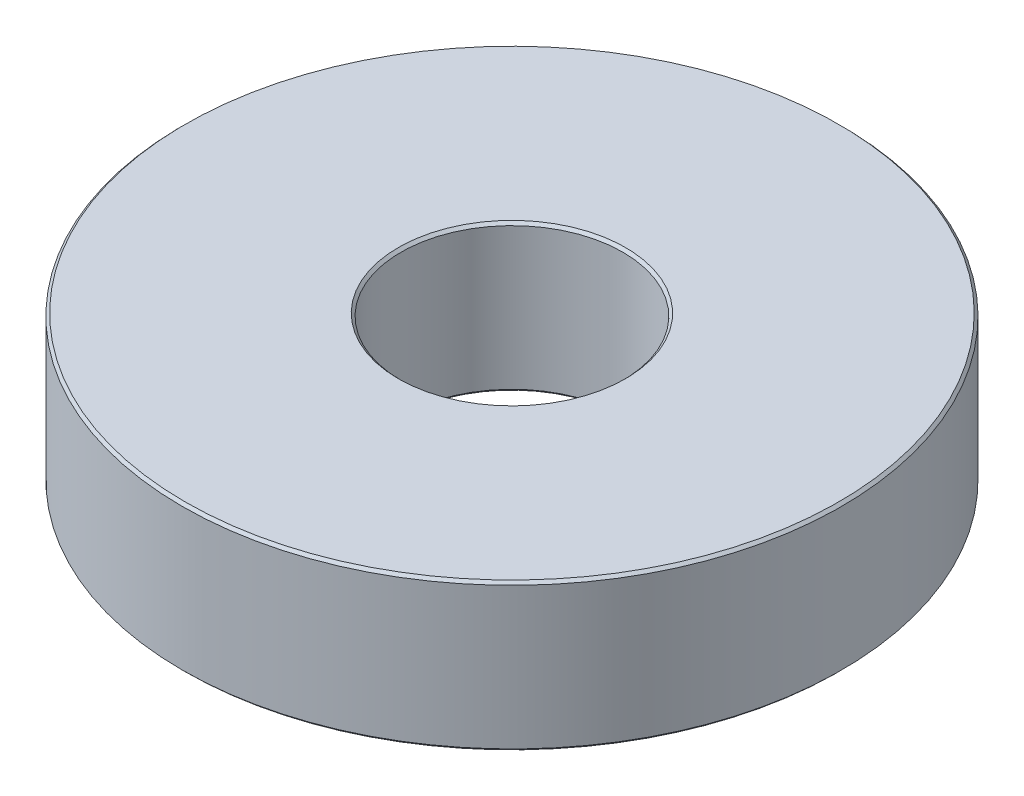
ISO-10303-21;
HEADER;
FILE_DESCRIPTION(('STEP AP214'),'2;1');
FILE_NAME('part.step','',(''),(''),'','','');
FILE_SCHEMA(('AUTOMOTIVE_DESIGN { 1 0 10303 214 1 1 1 1 }'));
ENDSEC;
DATA;
#1=APPLICATION_CONTEXT('core data for automotive mechanical design processes');
#2=APPLICATION_PROTOCOL_DEFINITION('international standard','automotive_design',2000,#1);
#3=PRODUCT_CONTEXT('',#1,'mechanical');
#4=PRODUCT('Part','Part','',(#3));
#5=PRODUCT_RELATED_PRODUCT_CATEGORY('part','',(#4));
#6=PRODUCT_DEFINITION_FORMATION('','',#4);
#7=PRODUCT_DEFINITION_CONTEXT('part definition',#1,'design');
#8=PRODUCT_DEFINITION('design','',#6,#7);
#9=PRODUCT_DEFINITION_SHAPE('','',#8);
#10=(LENGTH_UNIT() NAMED_UNIT(*) SI_UNIT(.MILLI.,.METRE.));
#11=(NAMED_UNIT(*) PLANE_ANGLE_UNIT() SI_UNIT($,.RADIAN.));
#12=(NAMED_UNIT(*) SI_UNIT($,.STERADIAN.) SOLID_ANGLE_UNIT());
#13=UNCERTAINTY_MEASURE_WITH_UNIT(LENGTH_MEASURE(1.E-05),#10,'distance_accuracy_value','');
#14=(GEOMETRIC_REPRESENTATION_CONTEXT(3) GLOBAL_UNCERTAINTY_ASSIGNED_CONTEXT((#13)) GLOBAL_UNIT_ASSIGNED_CONTEXT((#10,
#11,#12)) REPRESENTATION_CONTEXT('',''));
#15=CARTESIAN_POINT('',(0.,0.,0.));
#16=DIRECTION('',(0.,0.,1.));
#17=DIRECTION('',(1.,0.,0.));
#18=AXIS2_PLACEMENT_3D('',#15,#16,#17);
#19=CARTESIAN_POINT('',(0.,5.5,0.));
#20=DIRECTION('',(0.,1.,0.));
#21=DIRECTION('',(0.,0.,1.));
#22=AXIS2_PLACEMENT_3D('',#19,#20,#21);
#23=PLANE('',#22);
#24=CARTESIAN_POINT('',(0.,5.5,0.));
#25=DIRECTION('',(0.,1.,0.));
#26=DIRECTION('',(0.,0.,1.));
#27=AXIS2_PLACEMENT_3D('',#24,#25,#26);
#28=CIRCLE('',#27,4.25);
#29=CARTESIAN_POINT('',(0.,5.5,4.25));
#30=VERTEX_POINT('',#29);
#31=EDGE_CURVE('E54',#30,#30,#28,.F.);
#32=ORIENTED_EDGE('',*,*,#31,.T.);
#33=EDGE_LOOP('',(#32));
#34=FACE_BOUND('',#33,.T.);
#35=CARTESIAN_POINT('',(0.,5.5,0.));
#36=DIRECTION('',(0.,1.,0.));
#37=DIRECTION('',(0.,0.,1.));
#38=AXIS2_PLACEMENT_3D('',#35,#36,#37);
#39=CIRCLE('',#38,12.225);
#40=CARTESIAN_POINT('',(0.,5.5,12.225));
#41=VERTEX_POINT('',#40);
#42=EDGE_CURVE('E57',#41,#41,#39,.T.);
#43=ORIENTED_EDGE('',*,*,#42,.T.);
#44=EDGE_LOOP('',(#43));
#45=FACE_BOUND('',#44,.T.);
#46=ADVANCED_FACE('F33',(#34,#45),#23,.T.);
#47=CARTESIAN_POINT('',(0.,0.,0.));
#48=DIRECTION('',(0.,1.,0.));
#49=DIRECTION('',(0.,0.,1.));
#50=AXIS2_PLACEMENT_3D('',#47,#48,#49);
#51=PLANE('',#50);
#52=CARTESIAN_POINT('',(0.,0.,0.));
#53=DIRECTION('',(0.,1.,0.));
#54=DIRECTION('',(0.,0.,1.));
#55=AXIS2_PLACEMENT_3D('',#52,#53,#54);
#56=CIRCLE('',#55,4.25000000000001);
#57=CARTESIAN_POINT('',(0.,0.,4.25000000000001));
#58=VERTEX_POINT('',#57);
#59=EDGE_CURVE('E10',#58,#58,#56,.T.);
#60=ORIENTED_EDGE('',*,*,#59,.T.);
#61=EDGE_LOOP('',(#60));
#62=FACE_BOUND('',#61,.T.);
#63=CARTESIAN_POINT('',(0.,0.,0.));
#64=DIRECTION('',(0.,1.,0.));
#65=DIRECTION('',(0.,0.,1.));
#66=AXIS2_PLACEMENT_3D('',#63,#64,#65);
#67=CIRCLE('',#66,12.225);
#68=CARTESIAN_POINT('',(0.,0.,12.225));
#69=VERTEX_POINT('',#68);
#70=EDGE_CURVE('E41',#69,#69,#67,.F.);
#71=ORIENTED_EDGE('',*,*,#70,.T.);
#72=EDGE_LOOP('',(#71));
#73=FACE_BOUND('',#72,.T.);
#74=ADVANCED_FACE('F83',(#62,#73),#51,.F.);
#75=CARTESIAN_POINT('',(0.,5.5,0.));
#76=DIRECTION('',(0.,-1.,0.));
#77=DIRECTION('',(0.,0.,-1.));
#78=AXIS2_PLACEMENT_3D('',#75,#76,#77);
#79=CYLINDRICAL_SURFACE('',#78,12.325);
#80=CARTESIAN_POINT('',(0.,5.4,0.));
#81=DIRECTION('',(0.,1.,0.));
#82=DIRECTION('',(0.,0.,1.));
#83=AXIS2_PLACEMENT_3D('',#80,#81,#82);
#84=CIRCLE('',#83,12.325);
#85=CARTESIAN_POINT('',(0.,5.4,12.325));
#86=VERTEX_POINT('',#85);
#87=EDGE_CURVE('E45',#86,#86,#84,.F.);
#88=ORIENTED_EDGE('',*,*,#87,.T.);
#89=EDGE_LOOP('',(#88));
#90=FACE_BOUND('',#89,.T.);
#91=CARTESIAN_POINT('',(0.,0.0999999999999994,0.));
#92=DIRECTION('',(0.,1.,0.));
#93=DIRECTION('',(0.,0.,1.));
#94=AXIS2_PLACEMENT_3D('',#91,#92,#93);
#95=CIRCLE('',#94,12.325);
#96=CARTESIAN_POINT('',(0.,0.0999999999999994,12.325));
#97=VERTEX_POINT('',#96);
#98=EDGE_CURVE('E49',#97,#97,#95,.T.);
#99=ORIENTED_EDGE('',*,*,#98,.T.);
#100=EDGE_LOOP('',(#99));
#101=FACE_BOUND('',#100,.T.);
#102=ADVANCED_FACE('F89',(#90,#101),#79,.T.);
#103=CARTESIAN_POINT('',(0.,5.5,0.));
#104=DIRECTION('',(0.,-1.,0.));
#105=DIRECTION('',(0.,0.,-1.));
#106=AXIS2_PLACEMENT_3D('',#103,#104,#105);
#107=CYLINDRICAL_SURFACE('',#106,4.15);
#108=CARTESIAN_POINT('',(0.,5.4,0.));
#109=DIRECTION('',(0.,1.,0.));
#110=DIRECTION('',(0.,0.,1.));
#111=AXIS2_PLACEMENT_3D('',#108,#109,#110);
#112=CIRCLE('',#111,4.15);
#113=CARTESIAN_POINT('',(0.,5.4,4.15));
#114=VERTEX_POINT('',#113);
#115=EDGE_CURVE('E60',#114,#114,#112,.T.);
#116=ORIENTED_EDGE('',*,*,#115,.T.);
#117=EDGE_LOOP('',(#116));
#118=FACE_BOUND('',#117,.T.);
#119=CARTESIAN_POINT('',(0.,0.100000000000004,0.));
#120=DIRECTION('',(0.,1.,0.));
#121=DIRECTION('',(0.,0.,1.));
#122=AXIS2_PLACEMENT_3D('',#119,#120,#121);
#123=CIRCLE('',#122,4.15);
#124=CARTESIAN_POINT('',(0.,0.100000000000004,4.15));
#125=VERTEX_POINT('',#124);
#126=EDGE_CURVE('E63',#125,#125,#123,.F.);
#127=ORIENTED_EDGE('',*,*,#126,.T.);
#128=EDGE_LOOP('',(#127));
#129=FACE_BOUND('',#128,.T.);
#130=ADVANCED_FACE('F67',(#118,#129),#107,.F.);
#131=CARTESIAN_POINT('',(0.,5.4,0.));
#132=DIRECTION('',(0.,1.,0.));
#133=DIRECTION('',(0.,0.,1.));
#134=AXIS2_PLACEMENT_3D('',#131,#132,#133);
#135=CONICAL_SURFACE('',#134,4.15,0.785398163397448);
#136=ORIENTED_EDGE('',*,*,#31,.F.);
#137=EDGE_LOOP('',(#136));
#138=FACE_BOUND('',#137,.T.);
#139=ORIENTED_EDGE('',*,*,#115,.F.);
#140=EDGE_LOOP('',(#139));
#141=FACE_BOUND('',#140,.T.);
#142=ADVANCED_FACE('F78',(#138,#141),#135,.F.);
#143=CARTESIAN_POINT('',(0.,5.5,0.));
#144=DIRECTION('',(0.,-1.,0.));
#145=DIRECTION('',(0.,0.,-1.));
#146=AXIS2_PLACEMENT_3D('',#143,#144,#145);
#147=CONICAL_SURFACE('',#146,12.225,0.78539816339744);
#148=ORIENTED_EDGE('',*,*,#87,.F.);
#149=EDGE_LOOP('',(#148));
#150=FACE_BOUND('',#149,.T.);
#151=ORIENTED_EDGE('',*,*,#42,.F.);
#152=EDGE_LOOP('',(#151));
#153=FACE_BOUND('',#152,.T.);
#154=ADVANCED_FACE('F72',(#150,#153),#147,.T.);
#155=CARTESIAN_POINT('',(0.,0.,0.));
#156=DIRECTION('',(0.,-1.,0.));
#157=DIRECTION('',(0.,0.,-1.));
#158=AXIS2_PLACEMENT_3D('',#155,#156,#157);
#159=CONICAL_SURFACE('',#158,4.25000000000001,0.785398163397466);
#160=ORIENTED_EDGE('',*,*,#126,.F.);
#161=EDGE_LOOP('',(#160));
#162=FACE_BOUND('',#161,.T.);
#163=ORIENTED_EDGE('',*,*,#59,.F.);
#164=EDGE_LOOP('',(#163));
#165=FACE_BOUND('',#164,.T.);
#166=ADVANCED_FACE('F69',(#162,#165),#159,.F.);
#167=CARTESIAN_POINT('',(0.,0.0999999999999994,0.));
#168=DIRECTION('',(0.,1.,0.));
#169=DIRECTION('',(0.,0.,1.));
#170=AXIS2_PLACEMENT_3D('',#167,#168,#169);
#171=CONICAL_SURFACE('',#170,12.325,0.785398163397474);
#172=ORIENTED_EDGE('',*,*,#70,.F.);
#173=EDGE_LOOP('',(#172));
#174=FACE_BOUND('',#173,.T.);
#175=ORIENTED_EDGE('',*,*,#98,.F.);
#176=EDGE_LOOP('',(#175));
#177=FACE_BOUND('',#176,.T.);
#178=ADVANCED_FACE('F36',(#174,#177),#171,.T.);
#179=CLOSED_SHELL('',(#46,#74,#102,#130,#142,#154,#166,#178));
#180=MANIFOLD_SOLID_BREP('B2',#179);
#181=ADVANCED_BREP_SHAPE_REPRESENTATION('',(#18,#180),#14);
#182=SHAPE_DEFINITION_REPRESENTATION(#9,#181);
ENDSEC;
END-ISO-10303-21;
